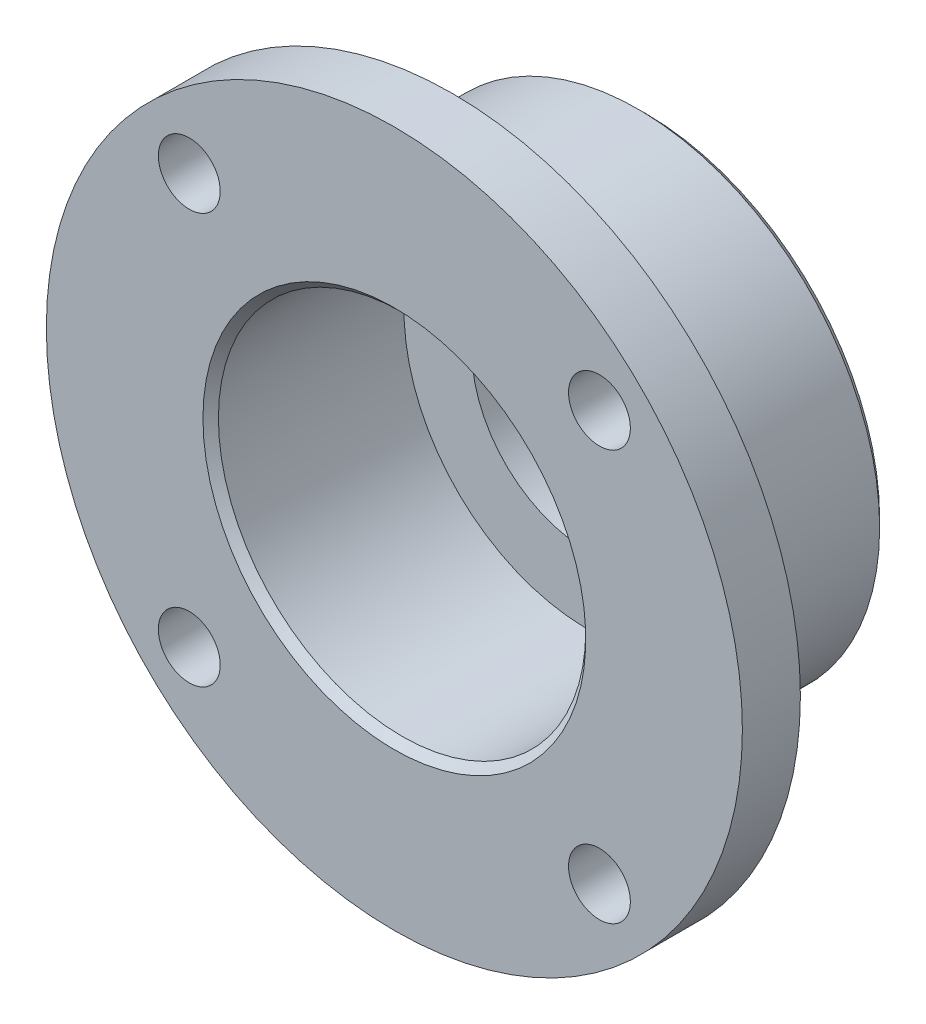
ISO-10303-21;
HEADER;
FILE_DESCRIPTION(('STEP AP214'),'2;1');
FILE_NAME('part.step','',(''),(''),'','','');
FILE_SCHEMA(('AUTOMOTIVE_DESIGN { 1 0 10303 214 1 1 1 1 }'));
ENDSEC;
DATA;
#1=APPLICATION_CONTEXT('core data for automotive mechanical design processes');
#2=APPLICATION_PROTOCOL_DEFINITION('international standard','automotive_design',2000,#1);
#3=PRODUCT_CONTEXT('',#1,'mechanical');
#4=PRODUCT('Part','Part','',(#3));
#5=PRODUCT_RELATED_PRODUCT_CATEGORY('part','',(#4));
#6=PRODUCT_DEFINITION_FORMATION('','',#4);
#7=PRODUCT_DEFINITION_CONTEXT('part definition',#1,'design');
#8=PRODUCT_DEFINITION('design','',#6,#7);
#9=PRODUCT_DEFINITION_SHAPE('','',#8);
#10=(LENGTH_UNIT() NAMED_UNIT(*) SI_UNIT(.MILLI.,.METRE.));
#11=(NAMED_UNIT(*) PLANE_ANGLE_UNIT() SI_UNIT($,.RADIAN.));
#12=(NAMED_UNIT(*) SI_UNIT($,.STERADIAN.) SOLID_ANGLE_UNIT());
#13=UNCERTAINTY_MEASURE_WITH_UNIT(LENGTH_MEASURE(1.E-05),#10,'distance_accuracy_value','');
#14=(GEOMETRIC_REPRESENTATION_CONTEXT(3) GLOBAL_UNCERTAINTY_ASSIGNED_CONTEXT((#13)) GLOBAL_UNIT_ASSIGNED_CONTEXT((#10,
#11,#12)) REPRESENTATION_CONTEXT('',''));
#15=CARTESIAN_POINT('',(0.,0.,0.));
#16=DIRECTION('',(0.,0.,1.));
#17=DIRECTION('',(1.,0.,0.));
#18=AXIS2_PLACEMENT_3D('',#15,#16,#17);
#19=CARTESIAN_POINT('',(-9.50000000000001,0.,0.));
#20=DIRECTION('',(0.,0.,-0.999999999999967));
#21=DIRECTION('',(-0.999999999999967,0.,0.));
#22=AXIS2_PLACEMENT_3D('',#19,#20,#21);
#23=PLANE('',#22);
#24=CARTESIAN_POINT('',(0.,0.,0.));
#25=DIRECTION('',(0.,0.,-0.999999999999967));
#26=DIRECTION('',(-0.999999999999967,0.,0.));
#27=AXIS2_PLACEMENT_3D('',#24,#25,#26);
#28=CIRCLE('',#27,9.90000000000001);
#29=CARTESIAN_POINT('',(-9.89999999999968,0.,0.));
#30=VERTEX_POINT('',#29);
#31=EDGE_CURVE('E12',#30,#30,#28,.T.);
#32=ORIENTED_EDGE('',*,*,#31,.T.);
#33=EDGE_LOOP('',(#32));
#34=FACE_BOUND('',#33,.T.);
#35=CARTESIAN_POINT('',(10.6066017177982,-10.6066017177984,0.));
#36=DIRECTION('',(0.,0.,0.999999999999967));
#37=DIRECTION('',(0.,-1.,0.));
#38=AXIS2_PLACEMENT_3D('',#35,#36,#37);
#39=CIRCLE('',#38,1.6);
#40=CARTESIAN_POINT('',(10.6066017177982,-12.2066017177984,0.));
#41=VERTEX_POINT('',#40);
#42=EDGE_CURVE('E101',#41,#41,#39,.T.);
#43=ORIENTED_EDGE('',*,*,#42,.F.);
#44=EDGE_LOOP('',(#43));
#45=FACE_BOUND('',#44,.T.);
#46=CARTESIAN_POINT('',(-10.6066017177982,-10.6066017177984,0.));
#47=DIRECTION('',(0.,0.,0.999999999999967));
#48=DIRECTION('',(-0.999999999999967,0.,0.));
#49=AXIS2_PLACEMENT_3D('',#46,#47,#48);
#50=CIRCLE('',#49,1.6);
#51=CARTESIAN_POINT('',(-12.2066017177982,-10.6066017177984,0.));
#52=VERTEX_POINT('',#51);
#53=EDGE_CURVE('E94',#52,#52,#50,.T.);
#54=ORIENTED_EDGE('',*,*,#53,.F.);
#55=EDGE_LOOP('',(#54));
#56=FACE_BOUND('',#55,.T.);
#57=CARTESIAN_POINT('',(-10.6066017177981,10.6066017177982,0.));
#58=DIRECTION('',(0.,0.,0.999999999999967));
#59=DIRECTION('',(0.,1.,0.));
#60=AXIS2_PLACEMENT_3D('',#57,#58,#59);
#61=CIRCLE('',#60,1.6);
#62=CARTESIAN_POINT('',(-10.6066017177981,12.2066017177982,0.));
#63=VERTEX_POINT('',#62);
#64=EDGE_CURVE('E95',#63,#63,#61,.T.);
#65=ORIENTED_EDGE('',*,*,#64,.F.);
#66=EDGE_LOOP('',(#65));
#67=FACE_BOUND('',#66,.T.);
#68=CARTESIAN_POINT('',(10.6066017177982,10.6066017177982,0.));
#69=DIRECTION('',(0.,0.,0.999999999999967));
#70=DIRECTION('',(0.999999999999967,0.,0.));
#71=AXIS2_PLACEMENT_3D('',#68,#69,#70);
#72=CIRCLE('',#71,1.6);
#73=CARTESIAN_POINT('',(12.2066017177982,10.6066017177982,0.));
#74=VERTEX_POINT('',#73);
#75=EDGE_CURVE('E87',#74,#74,#72,.T.);
#76=ORIENTED_EDGE('',*,*,#75,.F.);
#77=EDGE_LOOP('',(#76));
#78=FACE_BOUND('',#77,.T.);
#79=CARTESIAN_POINT('',(0.,0.,0.));
#80=DIRECTION('',(0.,0.,0.999999999999967));
#81=DIRECTION('',(0.999999999999967,0.,0.));
#82=AXIS2_PLACEMENT_3D('',#79,#80,#81);
#83=CIRCLE('',#82,18.);
#84=CARTESIAN_POINT('',(17.9999999999994,0.,0.));
#85=VERTEX_POINT('',#84);
#86=EDGE_CURVE('E66',#85,#85,#83,.T.);
#87=ORIENTED_EDGE('',*,*,#86,.T.);
#88=EDGE_LOOP('',(#87));
#89=FACE_BOUND('',#88,.T.);
#90=ADVANCED_FACE('F46',(#34,#45,#56,#67,#78,#89),#23,.F.);
#91=CARTESIAN_POINT('',(0.,0.,0.));
#92=DIRECTION('',(0.,0.,0.999999999999967));
#93=DIRECTION('',(0.999999999999967,0.,0.));
#94=AXIS2_PLACEMENT_3D('',#91,#92,#93);
#95=CYLINDRICAL_SURFACE('',#94,18.);
#96=ORIENTED_EDGE('',*,*,#86,.F.);
#97=EDGE_LOOP('',(#96));
#98=FACE_BOUND('',#97,.T.);
#99=CARTESIAN_POINT('',(0.,0.,-3.));
#100=DIRECTION('',(0.,0.,0.999999999999967));
#101=DIRECTION('',(0.999999999999967,0.,0.));
#102=AXIS2_PLACEMENT_3D('',#99,#100,#101);
#103=CIRCLE('',#102,18.);
#104=CARTESIAN_POINT('',(17.9999999999994,0.,-3.));
#105=VERTEX_POINT('',#104);
#106=EDGE_CURVE('E69',#105,#105,#103,.T.);
#107=ORIENTED_EDGE('',*,*,#106,.T.);
#108=EDGE_LOOP('',(#107));
#109=FACE_BOUND('',#108,.T.);
#110=ADVANCED_FACE('F114',(#98,#109),#95,.T.);
#111=CARTESIAN_POINT('',(-18.,0.,-2.99999999999999));
#112=DIRECTION('',(0.,0.,0.999999999999967));
#113=DIRECTION('',(0.999999999999967,0.,0.));
#114=AXIS2_PLACEMENT_3D('',#111,#112,#113);
#115=PLANE('',#114);
#116=CARTESIAN_POINT('',(10.6066017177982,-10.6066017177984,-3.));
#117=DIRECTION('',(0.,0.,0.999999999999967));
#118=DIRECTION('',(0.999999999999967,0.,0.));
#119=AXIS2_PLACEMENT_3D('',#116,#117,#118);
#120=CIRCLE('',#119,1.6);
#121=CARTESIAN_POINT('',(12.2066017177982,-10.6066017177984,-3.));
#122=VERTEX_POINT('',#121);
#123=EDGE_CURVE('E90',#122,#122,#120,.F.);
#124=ORIENTED_EDGE('',*,*,#123,.F.);
#125=EDGE_LOOP('',(#124));
#126=FACE_BOUND('',#125,.T.);
#127=CARTESIAN_POINT('',(-10.6066017177982,-10.6066017177984,-3.));
#128=DIRECTION('',(0.,0.,0.999999999999967));
#129=DIRECTION('',(0.999999999999967,0.,0.));
#130=AXIS2_PLACEMENT_3D('',#127,#128,#129);
#131=CIRCLE('',#130,1.6);
#132=CARTESIAN_POINT('',(-9.00660171779825,-10.6066017177984,-3.));
#133=VERTEX_POINT('',#132);
#134=EDGE_CURVE('E98',#133,#133,#131,.F.);
#135=ORIENTED_EDGE('',*,*,#134,.F.);
#136=EDGE_LOOP('',(#135));
#137=FACE_BOUND('',#136,.T.);
#138=CARTESIAN_POINT('',(-10.6066017177981,10.6066017177982,-3.));
#139=DIRECTION('',(0.,0.,0.999999999999967));
#140=DIRECTION('',(0.999999999999967,0.,0.));
#141=AXIS2_PLACEMENT_3D('',#138,#139,#140);
#142=CIRCLE('',#141,1.6);
#143=CARTESIAN_POINT('',(-9.00660171779817,10.6066017177982,-3.));
#144=VERTEX_POINT('',#143);
#145=EDGE_CURVE('E91',#144,#144,#142,.F.);
#146=ORIENTED_EDGE('',*,*,#145,.F.);
#147=EDGE_LOOP('',(#146));
#148=FACE_BOUND('',#147,.T.);
#149=CARTESIAN_POINT('',(10.6066017177982,10.6066017177982,-3.));
#150=DIRECTION('',(0.,0.,0.999999999999967));
#151=DIRECTION('',(0.999999999999967,0.,0.));
#152=AXIS2_PLACEMENT_3D('',#149,#150,#151);
#153=CIRCLE('',#152,1.6);
#154=CARTESIAN_POINT('',(12.2066017177982,10.6066017177982,-3.));
#155=VERTEX_POINT('',#154);
#156=EDGE_CURVE('E84',#155,#155,#153,.F.);
#157=ORIENTED_EDGE('',*,*,#156,.F.);
#158=EDGE_LOOP('',(#157));
#159=FACE_BOUND('',#158,.T.);
#160=ORIENTED_EDGE('',*,*,#106,.F.);
#161=EDGE_LOOP('',(#160));
#162=FACE_BOUND('',#161,.T.);
#163=CARTESIAN_POINT('',(0.,0.,-3.));
#164=DIRECTION('',(0.,0.,0.999999999999967));
#165=DIRECTION('',(0.999999999999967,0.,0.));
#166=AXIS2_PLACEMENT_3D('',#163,#164,#165);
#167=CIRCLE('',#166,12.5);
#168=CARTESIAN_POINT('',(12.4999999999996,0.,-3.));
#169=VERTEX_POINT('',#168);
#170=EDGE_CURVE('E72',#169,#169,#167,.T.);
#171=ORIENTED_EDGE('',*,*,#170,.T.);
#172=EDGE_LOOP('',(#171));
#173=FACE_BOUND('',#172,.T.);
#174=ADVANCED_FACE('F126',(#126,#137,#148,#159,#162,#173),#115,.F.);
#175=CARTESIAN_POINT('',(0.,0.,0.));
#176=DIRECTION('',(0.,0.,0.999999999999967));
#177=DIRECTION('',(0.999999999999967,0.,0.));
#178=AXIS2_PLACEMENT_3D('',#175,#176,#177);
#179=CYLINDRICAL_SURFACE('',#178,12.5);
#180=CARTESIAN_POINT('',(0.,0.,-12.6));
#181=DIRECTION('',(0.,0.,0.999999999999967));
#182=DIRECTION('',(0.999999999999967,0.,0.));
#183=AXIS2_PLACEMENT_3D('',#180,#181,#182);
#184=CIRCLE('',#183,12.5);
#185=CARTESIAN_POINT('',(12.4999999999996,0.,-12.6));
#186=VERTEX_POINT('',#185);
#187=EDGE_CURVE('E61',#186,#186,#184,.T.);
#188=ORIENTED_EDGE('',*,*,#187,.T.);
#189=EDGE_LOOP('',(#188));
#190=FACE_BOUND('',#189,.T.);
#191=ORIENTED_EDGE('',*,*,#170,.F.);
#192=EDGE_LOOP('',(#191));
#193=FACE_BOUND('',#192,.T.);
#194=ADVANCED_FACE('F132',(#190,#193),#179,.T.);
#195=CARTESIAN_POINT('',(-12.5,0.,-13.));
#196=DIRECTION('',(0.,0.,0.999999999999967));
#197=DIRECTION('',(0.999999999999967,0.,0.));
#198=AXIS2_PLACEMENT_3D('',#195,#196,#197);
#199=PLANE('',#198);
#200=CARTESIAN_POINT('',(0.,0.,-13.));
#201=DIRECTION('',(0.,0.,0.999999999999967));
#202=DIRECTION('',(0.999999999999967,0.,0.));
#203=AXIS2_PLACEMENT_3D('',#200,#201,#202);
#204=CIRCLE('',#203,12.1);
#205=CARTESIAN_POINT('',(12.0999999999996,0.,-13.));
#206=VERTEX_POINT('',#205);
#207=EDGE_CURVE('E57',#206,#206,#204,.F.);
#208=ORIENTED_EDGE('',*,*,#207,.T.);
#209=EDGE_LOOP('',(#208));
#210=FACE_BOUND('',#209,.T.);
#211=CARTESIAN_POINT('',(0.,0.,-13.));
#212=DIRECTION('',(0.,0.,0.999999999999967));
#213=DIRECTION('',(0.999999999999967,0.,0.));
#214=AXIS2_PLACEMENT_3D('',#211,#212,#213);
#215=CIRCLE('',#214,6.);
#216=CARTESIAN_POINT('',(5.9999999999998,0.,-13.));
#217=VERTEX_POINT('',#216);
#218=EDGE_CURVE('E75',#217,#217,#215,.T.);
#219=ORIENTED_EDGE('',*,*,#218,.T.);
#220=EDGE_LOOP('',(#219));
#221=FACE_BOUND('',#220,.T.);
#222=ADVANCED_FACE('F138',(#210,#221),#199,.F.);
#223=CARTESIAN_POINT('',(0.,0.,0.));
#224=DIRECTION('',(0.,0.,0.999999999999967));
#225=DIRECTION('',(0.999999999999967,0.,0.));
#226=AXIS2_PLACEMENT_3D('',#223,#224,#225);
#227=CYLINDRICAL_SURFACE('',#226,6.);
#228=ORIENTED_EDGE('',*,*,#218,.F.);
#229=EDGE_LOOP('',(#228));
#230=FACE_BOUND('',#229,.T.);
#231=CARTESIAN_POINT('',(0.,0.,-9.99999999999999));
#232=DIRECTION('',(0.,0.,0.999999999999967));
#233=DIRECTION('',(0.999999999999967,0.,0.));
#234=AXIS2_PLACEMENT_3D('',#231,#232,#233);
#235=CIRCLE('',#234,6.);
#236=CARTESIAN_POINT('',(5.9999999999998,0.,-9.99999999999999));
#237=VERTEX_POINT('',#236);
#238=EDGE_CURVE('E78',#237,#237,#235,.T.);
#239=ORIENTED_EDGE('',*,*,#238,.T.);
#240=EDGE_LOOP('',(#239));
#241=FACE_BOUND('',#240,.T.);
#242=ADVANCED_FACE('F144',(#230,#241),#227,.F.);
#243=CARTESIAN_POINT('',(-9.50000000000001,0.,-9.99999999999999));
#244=DIRECTION('',(0.,0.,-0.999999999999967));
#245=DIRECTION('',(-0.999999999999967,0.,0.));
#246=AXIS2_PLACEMENT_3D('',#243,#244,#245);
#247=PLANE('',#246);
#248=ORIENTED_EDGE('',*,*,#238,.F.);
#249=EDGE_LOOP('',(#248));
#250=FACE_BOUND('',#249,.T.);
#251=CARTESIAN_POINT('',(0.,0.,-9.99999999999999));
#252=DIRECTION('',(0.,0.,0.999999999999967));
#253=DIRECTION('',(0.999999999999967,0.,0.));
#254=AXIS2_PLACEMENT_3D('',#251,#252,#253);
#255=CIRCLE('',#254,9.5);
#256=CARTESIAN_POINT('',(9.49999999999969,0.,-9.99999999999999));
#257=VERTEX_POINT('',#256);
#258=EDGE_CURVE('E81',#257,#257,#255,.T.);
#259=ORIENTED_EDGE('',*,*,#258,.T.);
#260=EDGE_LOOP('',(#259));
#261=FACE_BOUND('',#260,.T.);
#262=ADVANCED_FACE('F166',(#250,#261),#247,.F.);
#263=CARTESIAN_POINT('',(0.,0.,0.));
#264=DIRECTION('',(0.,0.,0.999999999999967));
#265=DIRECTION('',(0.999999999999967,0.,0.));
#266=AXIS2_PLACEMENT_3D('',#263,#264,#265);
#267=CYLINDRICAL_SURFACE('',#266,9.5);
#268=CARTESIAN_POINT('',(0.,0.,-0.399999999999998));
#269=DIRECTION('',(0.,0.,-0.999999999999967));
#270=DIRECTION('',(-0.999999999999967,0.,0.));
#271=AXIS2_PLACEMENT_3D('',#268,#269,#270);
#272=CIRCLE('',#271,9.5);
#273=CARTESIAN_POINT('',(-9.49999999999969,0.,-0.399999999999998));
#274=VERTEX_POINT('',#273);
#275=EDGE_CURVE('E53',#274,#274,#272,.F.);
#276=ORIENTED_EDGE('',*,*,#275,.T.);
#277=EDGE_LOOP('',(#276));
#278=FACE_BOUND('',#277,.T.);
#279=ORIENTED_EDGE('',*,*,#258,.F.);
#280=EDGE_LOOP('',(#279));
#281=FACE_BOUND('',#280,.T.);
#282=ADVANCED_FACE('F171',(#278,#281),#267,.F.);
#283=CARTESIAN_POINT('',(10.6066017177982,10.6066017177982,-13.001));
#284=DIRECTION('',(0.,0.,0.999999999999967));
#285=DIRECTION('',(0.999999999999967,0.,0.));
#286=AXIS2_PLACEMENT_3D('',#283,#284,#285);
#287=CYLINDRICAL_SURFACE('',#286,1.6);
#288=ORIENTED_EDGE('',*,*,#75,.T.);
#289=EDGE_LOOP('',(#288));
#290=FACE_BOUND('',#289,.T.);
#291=ORIENTED_EDGE('',*,*,#156,.T.);
#292=EDGE_LOOP('',(#291));
#293=FACE_BOUND('',#292,.T.);
#294=ADVANCED_FACE('F176',(#290,#293),#287,.F.);
#295=CARTESIAN_POINT('',(-10.6066017177981,10.6066017177982,-13.001));
#296=DIRECTION('',(0.,0.,0.999999999999967));
#297=DIRECTION('',(0.999999999999967,0.,0.));
#298=AXIS2_PLACEMENT_3D('',#295,#296,#297);
#299=CYLINDRICAL_SURFACE('',#298,1.6);
#300=ORIENTED_EDGE('',*,*,#64,.T.);
#301=EDGE_LOOP('',(#300));
#302=FACE_BOUND('',#301,.T.);
#303=ORIENTED_EDGE('',*,*,#145,.T.);
#304=EDGE_LOOP('',(#303));
#305=FACE_BOUND('',#304,.T.);
#306=ADVANCED_FACE('F181',(#302,#305),#299,.F.);
#307=CARTESIAN_POINT('',(-10.6066017177982,-10.6066017177984,-13.001));
#308=DIRECTION('',(0.,0.,0.999999999999967));
#309=DIRECTION('',(0.999999999999967,0.,0.));
#310=AXIS2_PLACEMENT_3D('',#307,#308,#309);
#311=CYLINDRICAL_SURFACE('',#310,1.6);
#312=ORIENTED_EDGE('',*,*,#53,.T.);
#313=EDGE_LOOP('',(#312));
#314=FACE_BOUND('',#313,.T.);
#315=ORIENTED_EDGE('',*,*,#134,.T.);
#316=EDGE_LOOP('',(#315));
#317=FACE_BOUND('',#316,.T.);
#318=ADVANCED_FACE('F156',(#314,#317),#311,.F.);
#319=CARTESIAN_POINT('',(10.6066017177982,-10.6066017177984,-13.001));
#320=DIRECTION('',(0.,0.,0.999999999999967));
#321=DIRECTION('',(0.999999999999967,0.,0.));
#322=AXIS2_PLACEMENT_3D('',#319,#320,#321);
#323=CYLINDRICAL_SURFACE('',#322,1.6);
#324=ORIENTED_EDGE('',*,*,#42,.T.);
#325=EDGE_LOOP('',(#324));
#326=FACE_BOUND('',#325,.T.);
#327=ORIENTED_EDGE('',*,*,#123,.T.);
#328=EDGE_LOOP('',(#327));
#329=FACE_BOUND('',#328,.T.);
#330=ADVANCED_FACE('F109',(#326,#329),#323,.F.);
#331=CARTESIAN_POINT('',(0.,0.,-12.6));
#332=DIRECTION('',(0.,0.,0.999999999999967));
#333=DIRECTION('',(0.999999999999967,0.,0.));
#334=AXIS2_PLACEMENT_3D('',#331,#332,#333);
#335=CONICAL_SURFACE('',#334,12.5,0.785398163397448);
#336=ORIENTED_EDGE('',*,*,#207,.F.);
#337=EDGE_LOOP('',(#336));
#338=FACE_BOUND('',#337,.T.);
#339=ORIENTED_EDGE('',*,*,#187,.F.);
#340=EDGE_LOOP('',(#339));
#341=FACE_BOUND('',#340,.T.);
#342=ADVANCED_FACE('F148',(#338,#341),#335,.T.);
#343=CARTESIAN_POINT('',(0.,0.,-0.399999999999998));
#344=DIRECTION('',(0.,0.,0.999999999999967));
#345=DIRECTION('',(0.999999999999967,0.,0.));
#346=AXIS2_PLACEMENT_3D('',#343,#344,#345);
#347=CONICAL_SURFACE('',#346,9.5,0.785398163397459);
#348=ORIENTED_EDGE('',*,*,#31,.F.);
#349=EDGE_LOOP('',(#348));
#350=FACE_BOUND('',#349,.T.);
#351=ORIENTED_EDGE('',*,*,#275,.F.);
#352=EDGE_LOOP('',(#351));
#353=FACE_BOUND('',#352,.T.);
#354=ADVANCED_FACE('F48',(#350,#353),#347,.F.);
#355=CLOSED_SHELL('',(#90,#110,#174,#194,#222,#242,#262,#282,#294,#306,#318,#330,#342,#354));
#356=MANIFOLD_SOLID_BREP('B2',#355);
#357=ADVANCED_BREP_SHAPE_REPRESENTATION('',(#18,#356),#14);
#358=SHAPE_DEFINITION_REPRESENTATION(#9,#357);
ENDSEC;
END-ISO-10303-21;
